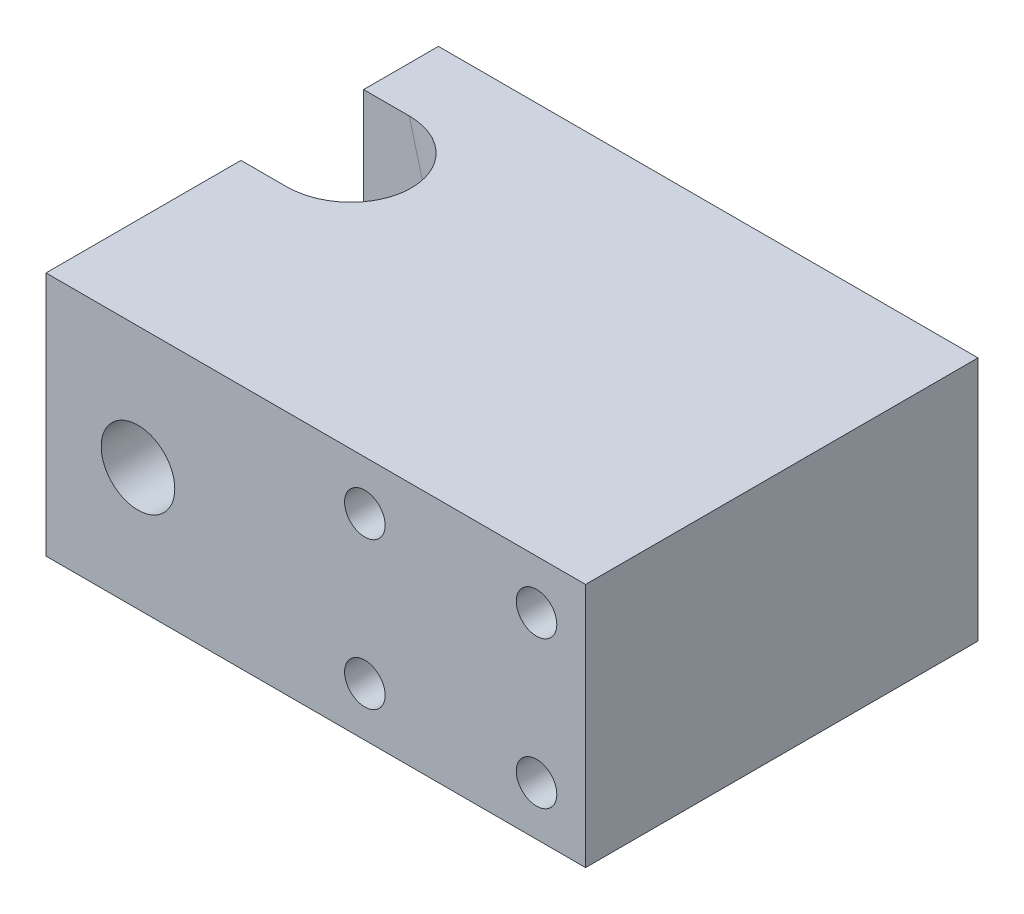
ISO-10303-21;
HEADER;
FILE_DESCRIPTION(('STEP AP214'),'2;1');
FILE_NAME('part.step','',(''),(''),'','','');
FILE_SCHEMA(('AUTOMOTIVE_DESIGN { 1 0 10303 214 1 1 1 1 }'));
ENDSEC;
DATA;
#1=APPLICATION_CONTEXT('core data for automotive mechanical design processes');
#2=APPLICATION_PROTOCOL_DEFINITION('international standard','automotive_design',2000,#1);
#3=PRODUCT_CONTEXT('',#1,'mechanical');
#4=PRODUCT('Part','Part','',(#3));
#5=PRODUCT_RELATED_PRODUCT_CATEGORY('part','',(#4));
#6=PRODUCT_DEFINITION_FORMATION('','',#4);
#7=PRODUCT_DEFINITION_CONTEXT('part definition',#1,'design');
#8=PRODUCT_DEFINITION('design','',#6,#7);
#9=PRODUCT_DEFINITION_SHAPE('','',#8);
#10=(LENGTH_UNIT() NAMED_UNIT(*) SI_UNIT(.MILLI.,.METRE.));
#11=(NAMED_UNIT(*) PLANE_ANGLE_UNIT() SI_UNIT($,.RADIAN.));
#12=(NAMED_UNIT(*) SI_UNIT($,.STERADIAN.) SOLID_ANGLE_UNIT());
#13=UNCERTAINTY_MEASURE_WITH_UNIT(LENGTH_MEASURE(1.E-05),#10,'distance_accuracy_value','');
#14=(GEOMETRIC_REPRESENTATION_CONTEXT(3) GLOBAL_UNCERTAINTY_ASSIGNED_CONTEXT((#13)) GLOBAL_UNIT_ASSIGNED_CONTEXT((#10,
#11,#12)) REPRESENTATION_CONTEXT('',''));
#15=CARTESIAN_POINT('',(0.,0.,0.));
#16=DIRECTION('',(0.,0.,1.));
#17=DIRECTION('',(1.,0.,0.));
#18=AXIS2_PLACEMENT_3D('',#15,#16,#17);
#19=CARTESIAN_POINT('',(0.,25.4,0.));
#20=DIRECTION('',(1.,0.,0.));
#21=DIRECTION('',(0.,0.,-1.));
#22=AXIS2_PLACEMENT_3D('',#19,#20,#21);
#23=PLANE('',#22);
#24=DIRECTION('',(0.,1.,0.));
#25=VECTOR('',#24,1.);
#26=CARTESIAN_POINT('',(0.,25.4,-20.19));
#27=LINE('',#26,#25);
#28=CARTESIAN_POINT('',(0.,0.,-20.19));
#29=VERTEX_POINT('',#28);
#30=CARTESIAN_POINT('',(0.,25.4,-20.19));
#31=VERTEX_POINT('',#30);
#32=EDGE_CURVE('E280',#29,#31,#27,.T.);
#33=ORIENTED_EDGE('',*,*,#32,.F.);
#34=DIRECTION('',(0.,0.,1.));
#35=VECTOR('',#34,1.);
#36=CARTESIAN_POINT('',(0.,0.,0.));
#37=LINE('',#36,#35);
#38=CARTESIAN_POINT('',(0.,0.,0.));
#39=VERTEX_POINT('',#38);
#40=EDGE_CURVE('E144',#29,#39,#37,.T.);
#41=ORIENTED_EDGE('',*,*,#40,.T.);
#42=DIRECTION('',(0.,-1.,0.));
#43=VECTOR('',#42,1.);
#44=CARTESIAN_POINT('',(0.,25.4,0.));
#45=LINE('',#44,#43);
#46=CARTESIAN_POINT('',(0.,25.4,0.));
#47=VERTEX_POINT('',#46);
#48=EDGE_CURVE('E181',#47,#39,#45,.T.);
#49=ORIENTED_EDGE('',*,*,#48,.F.);
#50=DIRECTION('',(0.,0.,1.));
#51=VECTOR('',#50,1.);
#52=CARTESIAN_POINT('',(0.,25.4,0.));
#53=LINE('',#52,#51);
#54=EDGE_CURVE('E159',#31,#47,#53,.T.);
#55=ORIENTED_EDGE('',*,*,#54,.F.);
#56=EDGE_LOOP('',(#33,#41,#49,#55));
#57=FACE_BOUND('',#56,.T.);
#58=ADVANCED_FACE('F37',(#57),#23,.F.);
#59=CARTESIAN_POINT('',(0.,25.4,0.));
#60=DIRECTION('',(0.,-1.,0.));
#61=DIRECTION('',(0.,0.,-1.));
#62=AXIS2_PLACEMENT_3D('',#59,#60,#61);
#63=PLANE('',#62);
#64=DIRECTION('',(1.,0.,0.));
#65=VECTOR('',#64,1.);
#66=CARTESIAN_POINT('',(0.,25.4,-20.19));
#67=LINE('',#66,#65);
#68=CARTESIAN_POINT('',(4.72442241257112,25.4,-20.19));
#69=VERTEX_POINT('',#68);
#70=EDGE_CURVE('E282',#31,#69,#67,.T.);
#71=ORIENTED_EDGE('',*,*,#70,.F.);
#72=ORIENTED_EDGE('',*,*,#54,.T.);
#73=DIRECTION('',(1.,0.,0.));
#74=VECTOR('',#73,1.);
#75=CARTESIAN_POINT('',(0.,25.4,0.));
#76=LINE('',#75,#74);
#77=CARTESIAN_POINT('',(55.88,25.4,0.));
#78=VERTEX_POINT('',#77);
#79=EDGE_CURVE('E158',#47,#78,#76,.T.);
#80=ORIENTED_EDGE('',*,*,#79,.T.);
#81=DIRECTION('',(0.,0.,-1.));
#82=VECTOR('',#81,1.);
#83=CARTESIAN_POINT('',(55.88,25.4,0.));
#84=LINE('',#83,#82);
#85=CARTESIAN_POINT('',(55.88,25.4,-40.64));
#86=VERTEX_POINT('',#85);
#87=EDGE_CURVE('E161',#78,#86,#84,.T.);
#88=ORIENTED_EDGE('',*,*,#87,.T.);
#89=DIRECTION('',(-1.,0.,0.));
#90=VECTOR('',#89,1.);
#91=CARTESIAN_POINT('',(0.,25.4,-40.64));
#92=LINE('',#91,#90);
#93=CARTESIAN_POINT('',(0.,25.4,-40.64));
#94=VERTEX_POINT('',#93);
#95=EDGE_CURVE('E163',#86,#94,#92,.T.);
#96=ORIENTED_EDGE('',*,*,#95,.T.);
#97=CARTESIAN_POINT('',(0.,25.4,-32.89));
#98=VERTEX_POINT('',#97);
#99=EDGE_CURVE('E155',#94,#98,#53,.T.);
#100=ORIENTED_EDGE('',*,*,#99,.T.);
#101=DIRECTION('',(1.,0.,0.));
#102=VECTOR('',#101,1.);
#103=CARTESIAN_POINT('',(0.,25.4,-32.89));
#104=LINE('',#103,#102);
#105=CARTESIAN_POINT('',(4.72442241257112,25.4,-32.89));
#106=VERTEX_POINT('',#105);
#107=EDGE_CURVE('E270',#98,#106,#104,.T.);
#108=ORIENTED_EDGE('',*,*,#107,.T.);
#109=CARTESIAN_POINT('',(4.72442241257112,25.4,-26.54));
#110=DIRECTION('',(0.,-1.,0.));
#111=DIRECTION('',(-1.,0.,0.));
#112=AXIS2_PLACEMENT_3D('',#109,#110,#111);
#113=ELLIPSE('',#112,6.57400374560403,6.35);
#114=EDGE_CURVE('E268',#106,#69,#113,.T.);
#115=ORIENTED_EDGE('',*,*,#114,.T.);
#116=EDGE_LOOP('',(#71,#72,#80,#88,#96,#100,#108,#115));
#117=FACE_BOUND('',#116,.T.);
#118=ADVANCED_FACE('F239',(#117),#63,.F.);
#119=CARTESIAN_POINT('',(0.,0.,0.));
#120=DIRECTION('',(0.,-1.,0.));
#121=DIRECTION('',(0.,0.,-1.));
#122=AXIS2_PLACEMENT_3D('',#119,#120,#121);
#123=PLANE('',#122);
#124=ORIENTED_EDGE('',*,*,#40,.F.);
#125=DIRECTION('',(1.,0.,0.));
#126=VECTOR('',#125,1.);
#127=CARTESIAN_POINT('',(0.,0.,-20.19));
#128=LINE('',#127,#126);
#129=CARTESIAN_POINT('',(11.5303319003217,0.,-20.19));
#130=VERTEX_POINT('',#129);
#131=EDGE_CURVE('E278',#29,#130,#128,.T.);
#132=ORIENTED_EDGE('',*,*,#131,.T.);
#133=CARTESIAN_POINT('',(11.5303319003217,0.,-26.54));
#134=DIRECTION('',(0.,-1.,0.));
#135=DIRECTION('',(-1.,0.,0.));
#136=AXIS2_PLACEMENT_3D('',#133,#134,#135);
#137=ELLIPSE('',#136,6.57400374560403,6.35);
#138=CARTESIAN_POINT('',(11.5303319003217,0.,-32.89));
#139=VERTEX_POINT('',#138);
#140=EDGE_CURVE('E131',#139,#130,#137,.T.);
#141=ORIENTED_EDGE('',*,*,#140,.F.);
#142=DIRECTION('',(1.,0.,0.));
#143=VECTOR('',#142,1.);
#144=CARTESIAN_POINT('',(0.,0.,-32.89));
#145=LINE('',#144,#143);
#146=CARTESIAN_POINT('',(0.,0.,-32.89));
#147=VERTEX_POINT('',#146);
#148=EDGE_CURVE('E129',#147,#139,#145,.T.);
#149=ORIENTED_EDGE('',*,*,#148,.F.);
#150=CARTESIAN_POINT('',(0.,0.,-40.64));
#151=VERTEX_POINT('',#150);
#152=EDGE_CURVE('E147',#151,#147,#37,.T.);
#153=ORIENTED_EDGE('',*,*,#152,.F.);
#154=DIRECTION('',(-1.,0.,0.));
#155=VECTOR('',#154,1.);
#156=CARTESIAN_POINT('',(0.,0.,-40.64));
#157=LINE('',#156,#155);
#158=CARTESIAN_POINT('',(55.88,0.,-40.64));
#159=VERTEX_POINT('',#158);
#160=EDGE_CURVE('E171',#159,#151,#157,.T.);
#161=ORIENTED_EDGE('',*,*,#160,.F.);
#162=DIRECTION('',(0.,0.,-1.));
#163=VECTOR('',#162,1.);
#164=CARTESIAN_POINT('',(55.88,0.,0.));
#165=LINE('',#164,#163);
#166=CARTESIAN_POINT('',(55.88,0.,0.));
#167=VERTEX_POINT('',#166);
#168=EDGE_CURVE('E169',#167,#159,#165,.T.);
#169=ORIENTED_EDGE('',*,*,#168,.F.);
#170=DIRECTION('',(1.,0.,0.));
#171=VECTOR('',#170,1.);
#172=CARTESIAN_POINT('',(0.,0.,0.));
#173=LINE('',#172,#171);
#174=EDGE_CURVE('E167',#39,#167,#173,.T.);
#175=ORIENTED_EDGE('',*,*,#174,.F.);
#176=EDGE_LOOP('',(#124,#132,#141,#149,#153,#161,#169,#175));
#177=FACE_BOUND('',#176,.T.);
#178=ADVANCED_FACE('F244',(#177),#123,.T.);
#179=CARTESIAN_POINT('',(9.525,12.7,-40.64));
#180=DIRECTION('',(0.,0.,1.));
#181=DIRECTION('',(1.,0.,0.));
#182=AXIS2_PLACEMENT_3D('',#179,#180,#181);
#183=CYLINDRICAL_SURFACE('',#182,3.81);
#184=CARTESIAN_POINT('',(9.525,12.7,0.));
#185=DIRECTION('',(0.,0.,1.));
#186=DIRECTION('',(1.,0.,0.));
#187=AXIS2_PLACEMENT_3D('',#184,#185,#186);
#188=CIRCLE('',#187,3.81);
#189=CARTESIAN_POINT('',(13.335,12.7,0.));
#190=VERTEX_POINT('',#189);
#191=EDGE_CURVE('E145',#190,#190,#188,.T.);
#192=ORIENTED_EDGE('',*,*,#191,.T.);
#193=EDGE_LOOP('',(#192));
#194=FACE_BOUND('',#193,.T.);
#195=CARTESIAN_POINT('',(9.525,12.7,-20.19));
#196=DIRECTION('',(0.,0.,-1.));
#197=DIRECTION('',(-1.,0.,0.));
#198=AXIS2_PLACEMENT_3D('',#195,#196,#197);
#199=CIRCLE('',#198,3.81);
#200=CARTESIAN_POINT('',(7.29887760075357,15.7920024358938,-20.19));
#201=VERTEX_POINT('',#200);
#202=CARTESIAN_POINT('',(9.14312266826595,8.90918614232936,-20.19));
#203=VERTEX_POINT('',#202);
#204=EDGE_CURVE('E125',#201,#203,#199,.F.);
#205=ORIENTED_EDGE('',*,*,#204,.F.);
#206=CARTESIAN_POINT('',(7.29887760075357,15.7920024358938,-20.19));
#207=CARTESIAN_POINT('',(7.37588821554804,15.8474677696084,-20.189983748668));
#208=CARTESIAN_POINT('',(7.45499525906798,15.900032428448,-20.191859662143));
#209=CARTESIAN_POINT('',(7.61675874663452,15.999041260314,-20.1996000488794));
#210=CARTESIAN_POINT('',(7.69941503588709,16.0454856999041,-20.2054643483597));
#211=CARTESIAN_POINT('',(7.86730898172459,16.1317695337751,-20.2213543357153));
#212=CARTESIAN_POINT('',(7.95253518481344,16.1716342305359,-20.2313635369643));
#213=CARTESIAN_POINT('',(8.1251776097193,16.2447686062806,-20.2556195622989));
#214=CARTESIAN_POINT('',(8.21259371927783,16.2780386225435,-20.2698661695729));
#215=CARTESIAN_POINT('',(8.38894413758513,16.337876643913,-20.3025910657021));
#216=CARTESIAN_POINT('',(8.47787884528105,16.3644428580338,-20.3210704828834));
#217=CARTESIAN_POINT('',(8.65655973171753,16.4108554034493,-20.3621456306375));
#218=CARTESIAN_POINT('',(8.74630620762368,16.4306991624093,-20.3847429318357));
#219=CARTESIAN_POINT('',(9.01576942865032,16.4802203092433,-20.4584586470324));
#220=CARTESIAN_POINT('',(9.19580400877357,16.4999189391056,-20.5155183812784));
#221=CARTESIAN_POINT('',(9.55740442674199,16.514301389552,-20.6451548398031));
#222=CARTESIAN_POINT('',(9.7388410393498,16.5081808608286,-20.7181622944671));
#223=CARTESIAN_POINT('',(10.0940870566885,16.471490873795,-20.8755360491311));
#224=CARTESIAN_POINT('',(10.2678942133258,16.4409142596001,-20.9599056677061));
#225=CARTESIAN_POINT('',(10.6337600080237,16.3507446674273,-21.1515222889631));
#226=CARTESIAN_POINT('',(10.8240561181414,16.2871761829935,-21.2602416778512));
#227=CARTESIAN_POINT('',(11.1897887415193,16.1327970347096,-21.4839378036471));
#228=CARTESIAN_POINT('',(11.3651949913833,16.0419325157285,-21.5989265394609));
#229=CARTESIAN_POINT('',(11.6327559764238,15.8760650565887,-21.7832255731062));
#230=CARTESIAN_POINT('',(11.7301636468208,15.8092385447935,-21.8524231128882));
#231=CARTESIAN_POINT('',(11.9189831983781,15.6663065585903,-21.9895851215926));
#232=CARTESIAN_POINT('',(12.0103925181879,15.5901971594516,-22.0575490549076));
#233=CARTESIAN_POINT('',(12.186699091233,15.4286860036282,-22.1903254947206));
#234=CARTESIAN_POINT('',(12.271608472899,15.3433023100964,-22.2551437836971));
#235=CARTESIAN_POINT('',(12.4345672710965,15.1627799438534,-22.3794538412913));
#236=CARTESIAN_POINT('',(12.5126227878937,15.0676501125065,-22.4389503474479));
#237=CARTESIAN_POINT('',(12.6675599693142,14.8584274322646,-22.554496611453));
#238=CARTESIAN_POINT('',(12.7437588516888,14.743406547188,-22.6098056671192));
#239=CARTESIAN_POINT('',(12.885304360886,14.5011126276498,-22.7055906338988));
#240=CARTESIAN_POINT('',(12.9506715857715,14.3738635925792,-22.7460948797866));
#241=CARTESIAN_POINT('',(13.0390172408645,14.1741791748021,-22.7918313790436));
#242=CARTESIAN_POINT('',(13.0670101721369,14.1056347546324,-22.8046091088589));
#243=CARTESIAN_POINT('',(13.1191729260859,13.9663103796,-22.8243815057154));
#244=CARTESIAN_POINT('',(13.1433448130121,13.8955316567449,-22.8313793039524));
#245=CARTESIAN_POINT('',(13.1875390847034,13.7523850833845,-22.8392294083607));
#246=CARTESIAN_POINT('',(13.2075633369184,13.6800179643491,-22.840084486125));
#247=CARTESIAN_POINT('',(13.2432599202725,13.5344282637572,-22.8356248883296));
#248=CARTESIAN_POINT('',(13.258932503988,13.4612057321071,-22.8303105709425));
#249=CARTESIAN_POINT('',(13.295360906114,13.2626975623718,-22.8078879609613));
#250=CARTESIAN_POINT('',(13.3118686616062,13.1372275888669,-22.7850956852954));
#251=CARTESIAN_POINT('',(13.332371116634,12.8888094550595,-22.7251658916225));
#252=CARTESIAN_POINT('',(13.3363512757895,12.76586438957,-22.6880117603625));
#253=CARTESIAN_POINT('',(13.331798150708,12.451091174922,-22.5774503932035));
#254=CARTESIAN_POINT('',(13.3142963453879,12.2623192089441,-22.495680170807));
#255=CARTESIAN_POINT('',(13.2690420392041,11.9880354186318,-22.3618875497663));
#256=CARTESIAN_POINT('',(13.2507329225683,11.8979101852149,-22.3153263800793));
#257=CARTESIAN_POINT('',(13.2080770383771,11.7205357261821,-22.2195536469465));
#258=CARTESIAN_POINT('',(13.1837320031273,11.6332856835135,-22.17034284711));
#259=CARTESIAN_POINT('',(13.1189942971672,11.429297212113,-22.0513691852098));
#260=CARTESIAN_POINT('',(13.0760107384433,11.3138256146842,-21.9808448143921));
#261=CARTESIAN_POINT('',(12.9794511068012,11.0881910068086,-21.8385059267657));
#262=CARTESIAN_POINT('',(12.925871111969,10.9780299807233,-21.7666909412533));
#263=CARTESIAN_POINT('',(12.8083198557379,10.7632829417686,-21.62340733836));
#264=CARTESIAN_POINT('',(12.7443565219227,10.6586927558935,-21.5519384992361));
#265=CARTESIAN_POINT('',(12.6060811195501,10.4554134594179,-21.4106712361812));
#266=CARTESIAN_POINT('',(12.5317671778308,10.3567254215674,-21.3408731172879));
#267=CARTESIAN_POINT('',(12.319524489147,10.1019941222244,-21.1584905381409));
#268=CARTESIAN_POINT('',(12.1722426910152,9.9516347922979,-21.0484434701866));
#269=CARTESIAN_POINT('',(11.9302919745705,9.74331312286687,-20.893990014485));
#270=CARTESIAN_POINT('',(11.8461725202371,9.67676383647853,-20.8442916899503));
#271=CARTESIAN_POINT('',(11.6710281769443,9.5500264687455,-20.7490417922428));
#272=CARTESIAN_POINT('',(11.5800044084807,9.48983735899078,-20.7034895488343));
#273=CARTESIAN_POINT('',(11.4065641607914,9.38573640560393,-20.6241582645925));
#274=CARTESIAN_POINT('',(11.325109893876,9.34076238309594,-20.5896629082002));
#275=CARTESIAN_POINT('',(11.1579141225255,9.25638923520169,-20.5244655034477));
#276=CARTESIAN_POINT('',(11.072173421826,9.21698906994591,-20.4937627476686));
#277=CARTESIAN_POINT('',(10.8968513236891,9.14428273971723,-20.436494784781));
#278=CARTESIAN_POINT('',(10.8072715397538,9.1109740450112,-20.4099278607837));
#279=CARTESIAN_POINT('',(10.6248083210705,9.05092568366541,-20.3611971147265));
#280=CARTESIAN_POINT('',(10.531926091169,9.02418364887009,-20.3390317058875));
#281=CARTESIAN_POINT('',(10.3340241147508,8.97535567696632,-20.2972898003389));
#282=CARTESIAN_POINT('',(10.2287199917924,8.95400362821173,-20.2781944513378));
#283=CARTESIAN_POINT('',(10.0158170628798,8.92020862381462,-20.2456477276708));
#284=CARTESIAN_POINT('',(9.90821791558504,8.90776700307623,-20.2321971988012));
#285=CARTESIAN_POINT('',(9.6910299364845,8.89205358089758,-20.2108069067747));
#286=CARTESIAN_POINT('',(9.58143238108303,8.8888479401425,-20.2029072090759));
#287=CARTESIAN_POINT('',(9.3621001690675,8.89189588249173,-20.1924885263736));
#288=CARTESIAN_POINT('',(9.25236549894755,8.89815048533763,-20.1899701215028));
#289=CARTESIAN_POINT('',(9.14312266826595,8.90918614232937,-20.19));
#290=B_SPLINE_CURVE_WITH_KNOTS('',3,(#206,#207,#208,#209,#210,#211,#212,#213,#214,#215,#216,
#217,#218,#219,#220,#221,#222,#223,#224,#225,#226,#227,#228,#229,#230,#231,#232,#233,#234,#235,
#236,#237,#238,#239,#240,#241,#242,#243,#244,#245,#246,#247,#248,#249,#250,#251,#252,#253,#254,
#255,#256,#257,#258,#259,#260,#261,#262,#263,#264,#265,#266,#267,#268,#269,#270,#271,#272,#273,
#274,#275,#276,#277,#278,#279,#280,#281,#282,#283,#284,#285,#286,#287,#288,#289),.UNSPECIFIED.,
.F.,.F.,(4,2,2,2,2,2,2,2,2,2,2,2,2,2,2,2,2,2,2,2,2,2,2,2,2,2,2,2,2,2,2,2,2,2,2,2,2,2,2,2,2,4),
(0.,0.284639796308757,0.569267191144455,0.852773172920135,1.13626465129527,1.41983178717432,
1.70350730723625,2.27056003771185,2.85540660777862,3.44042436739706,4.12259723151591,
4.80612496396936,5.21644933821461,5.62694779964627,6.03666062006325,6.44600499986505,
6.89067986637461,7.33449916183455,7.55960136588614,7.78458154388661,8.00946020453746,
8.23432581020603,8.61827648761896,9.00267264026686,9.61831983316983,9.92741875769708,
10.2364290734737,10.6617930262583,11.0873147088067,11.512513024401,11.9377883888725,
12.6469206028601,13.0012212880588,13.3554645965918,13.6528709841303,13.9502218135832,
14.2474488740821,14.5445685866904,14.8714257531556,15.1983318770626,15.5275739959331,
15.8568516071041),.UNSPECIFIED.);
#291=EDGE_CURVE('E184',#201,#203,#290,.T.);
#292=ORIENTED_EDGE('',*,*,#291,.T.);
#293=EDGE_LOOP('',(#205,#292));
#294=FACE_BOUND('',#293,.T.);
#295=ADVANCED_FACE('F139',(#194,#294),#183,.F.);
#296=CARTESIAN_POINT('',(0.,25.4,0.));
#297=DIRECTION('',(0.,0.,-1.));
#298=DIRECTION('',(-1.,0.,0.));
#299=AXIS2_PLACEMENT_3D('',#296,#297,#298);
#300=PLANE('',#299);
#301=CARTESIAN_POINT('',(50.8,5.08,0.));
#302=DIRECTION('',(0.,0.,1.));
#303=DIRECTION('',(1.,0.,0.));
#304=AXIS2_PLACEMENT_3D('',#301,#302,#303);
#305=CIRCLE('',#304,2.1);
#306=CARTESIAN_POINT('',(52.9,5.08,0.));
#307=VERTEX_POINT('',#306);
#308=EDGE_CURVE('E284',#307,#307,#305,.T.);
#309=ORIENTED_EDGE('',*,*,#308,.F.);
#310=EDGE_LOOP('',(#309));
#311=FACE_BOUND('',#310,.T.);
#312=CARTESIAN_POINT('',(33.02,5.07999999999988,0.));
#313=DIRECTION('',(0.,0.,1.));
#314=DIRECTION('',(1.,0.,0.));
#315=AXIS2_PLACEMENT_3D('',#312,#313,#314);
#316=CIRCLE('',#315,2.1);
#317=CARTESIAN_POINT('',(35.12,5.07999999999988,0.));
#318=VERTEX_POINT('',#317);
#319=EDGE_CURVE('E290',#318,#318,#316,.T.);
#320=ORIENTED_EDGE('',*,*,#319,.F.);
#321=EDGE_LOOP('',(#320));
#322=FACE_BOUND('',#321,.T.);
#323=CARTESIAN_POINT('',(33.02,20.3199999999999,0.));
#324=DIRECTION('',(0.,0.,1.));
#325=DIRECTION('',(1.,0.,0.));
#326=AXIS2_PLACEMENT_3D('',#323,#324,#325);
#327=CIRCLE('',#326,2.1);
#328=CARTESIAN_POINT('',(35.1199999999999,20.3199999999999,0.));
#329=VERTEX_POINT('',#328);
#330=EDGE_CURVE('E296',#329,#329,#327,.T.);
#331=ORIENTED_EDGE('',*,*,#330,.F.);
#332=EDGE_LOOP('',(#331));
#333=FACE_BOUND('',#332,.T.);
#334=ORIENTED_EDGE('',*,*,#174,.T.);
#335=DIRECTION('',(0.,-1.,0.));
#336=VECTOR('',#335,1.);
#337=CARTESIAN_POINT('',(55.88,25.4,0.));
#338=LINE('',#337,#336);
#339=EDGE_CURVE('E178',#78,#167,#338,.T.);
#340=ORIENTED_EDGE('',*,*,#339,.F.);
#341=ORIENTED_EDGE('',*,*,#79,.F.);
#342=ORIENTED_EDGE('',*,*,#48,.T.);
#343=EDGE_LOOP('',(#334,#340,#341,#342));
#344=FACE_BOUND('',#343,.T.);
#345=ORIENTED_EDGE('',*,*,#191,.F.);
#346=EDGE_LOOP('',(#345));
#347=FACE_BOUND('',#346,.T.);
#348=CARTESIAN_POINT('',(50.7999999999999,20.32,0.));
#349=DIRECTION('',(0.,0.,1.));
#350=DIRECTION('',(1.,0.,0.));
#351=AXIS2_PLACEMENT_3D('',#348,#349,#350);
#352=CIRCLE('',#351,2.1);
#353=CARTESIAN_POINT('',(52.8999999999999,20.32,0.));
#354=VERTEX_POINT('',#353);
#355=EDGE_CURVE('E301',#354,#354,#352,.T.);
#356=ORIENTED_EDGE('',*,*,#355,.F.);
#357=EDGE_LOOP('',(#356));
#358=FACE_BOUND('',#357,.T.);
#359=ADVANCED_FACE('F249',(#311,#322,#333,#344,#347,#358),#300,.F.);
#360=ORIENTED_EDGE('',*,*,#152,.T.);
#361=DIRECTION('',(0.,1.,0.));
#362=VECTOR('',#361,1.);
#363=CARTESIAN_POINT('',(0.,25.4,-32.89));
#364=LINE('',#363,#362);
#365=EDGE_CURVE('E261',#147,#98,#364,.T.);
#366=ORIENTED_EDGE('',*,*,#365,.T.);
#367=ORIENTED_EDGE('',*,*,#99,.F.);
#368=DIRECTION('',(0.,-1.,0.));
#369=VECTOR('',#368,1.);
#370=CARTESIAN_POINT('',(0.,25.4,-40.64));
#371=LINE('',#370,#369);
#372=EDGE_CURVE('E164',#94,#151,#371,.T.);
#373=ORIENTED_EDGE('',*,*,#372,.T.);
#374=EDGE_LOOP('',(#360,#366,#367,#373));
#375=FACE_BOUND('',#374,.T.);
#376=ADVANCED_FACE('F39',(#375),#23,.F.);
#377=CARTESIAN_POINT('',(55.88,25.4,0.));
#378=DIRECTION('',(-1.,0.,0.));
#379=DIRECTION('',(0.,0.,1.));
#380=AXIS2_PLACEMENT_3D('',#377,#378,#379);
#381=PLANE('',#380);
#382=ORIENTED_EDGE('',*,*,#168,.T.);
#383=DIRECTION('',(0.,-1.,0.));
#384=VECTOR('',#383,1.);
#385=CARTESIAN_POINT('',(55.88,25.4,-40.64));
#386=LINE('',#385,#384);
#387=EDGE_CURVE('E175',#86,#159,#386,.T.);
#388=ORIENTED_EDGE('',*,*,#387,.F.);
#389=ORIENTED_EDGE('',*,*,#87,.F.);
#390=ORIENTED_EDGE('',*,*,#339,.T.);
#391=EDGE_LOOP('',(#382,#388,#389,#390));
#392=FACE_BOUND('',#391,.T.);
#393=ADVANCED_FACE('F248',(#392),#381,.F.);
#394=CARTESIAN_POINT('',(0.,25.4,-40.64));
#395=DIRECTION('',(0.,0.,1.));
#396=DIRECTION('',(1.,0.,0.));
#397=AXIS2_PLACEMENT_3D('',#394,#395,#396);
#398=PLANE('',#397);
#399=CARTESIAN_POINT('',(9.525,12.7,-40.64));
#400=DIRECTION('',(0.,0.,1.));
#401=DIRECTION('',(1.,0.,0.));
#402=AXIS2_PLACEMENT_3D('',#399,#400,#401);
#403=CIRCLE('',#402,3.81);
#404=CARTESIAN_POINT('',(13.335,12.7,-40.64));
#405=VERTEX_POINT('',#404);
#406=EDGE_CURVE('E142',#405,#405,#403,.T.);
#407=ORIENTED_EDGE('',*,*,#406,.T.);
#408=EDGE_LOOP('',(#407));
#409=FACE_BOUND('',#408,.T.);
#410=ORIENTED_EDGE('',*,*,#160,.T.);
#411=ORIENTED_EDGE('',*,*,#372,.F.);
#412=ORIENTED_EDGE('',*,*,#95,.F.);
#413=ORIENTED_EDGE('',*,*,#387,.T.);
#414=EDGE_LOOP('',(#410,#411,#412,#413));
#415=FACE_BOUND('',#414,.T.);
#416=ADVANCED_FACE('F137',(#409,#415),#398,.F.);
#417=CARTESIAN_POINT('',(9.14312266826595,8.90918614232936,-32.89));
#418=CARTESIAN_POINT('',(9.23754848389631,8.89965706170037,-32.890016251332));
#419=CARTESIAN_POINT('',(9.33233952262265,8.89368825356401,-32.888140337857));
#420=CARTESIAN_POINT('',(9.52193522819303,8.88882583375232,-32.8803999511206));
#421=CARTESIAN_POINT('',(9.61673989426337,8.88993191382904,-32.8745356516403));
#422=CARTESIAN_POINT('',(9.80528223343576,8.89915489467957,-32.8586456642847));
#423=CARTESIAN_POINT('',(9.89902263875918,8.90724415611499,-32.8486364630357));
#424=CARTESIAN_POINT('',(10.085102552371,8.93022914128311,-32.8243804377011));
#425=CARTESIAN_POINT('',(10.1774421320801,8.9451245167944,-32.8101338304271));
#426=CARTESIAN_POINT('',(10.360085084987,8.98147847932986,-32.7774089342979));
#427=CARTESIAN_POINT('',(10.4503879081902,9.00293881686678,-32.7589295171166));
#428=CARTESIAN_POINT('',(10.6283363677227,9.05208481670092,-32.7178543693625));
#429=CARTESIAN_POINT('',(10.7159809752375,9.07977285528803,-32.6952570681643));
#430=CARTESIAN_POINT('',(10.9741035434492,9.17161789461857,-32.6215413529676));
#431=CARTESIAN_POINT('',(11.1398673783267,9.24457567079975,-32.5644816187216));
#432=CARTESIAN_POINT('',(11.4602137515297,9.41292031232866,-32.4348451601969));
#433=CARTESIAN_POINT('',(11.6142822028629,9.50893915199161,-32.3618377055329));
#434=CARTESIAN_POINT('',(11.9035892849547,9.71833662149662,-32.2044639508689));
#435=CARTESIAN_POINT('',(12.0388223908646,9.83172032446978,-32.1200943322939));
#436=CARTESIAN_POINT('',(12.3105866673624,10.0927423792893,-31.9284777110369));
#437=CARTESIAN_POINT('',(12.4436036907488,10.2429423567479,-31.8197583221487));
#438=CARTESIAN_POINT('',(12.6831478594448,10.5595049326653,-31.5960621963529));
#439=CARTESIAN_POINT('',(12.7896218683191,10.7258990393375,-31.4810734605391));
#440=CARTESIAN_POINT('',(12.9384027488558,11.003324965134,-31.2967744268938));
#441=CARTESIAN_POINT('',(12.9893470100455,11.1099022571935,-31.2275768871118));
#442=CARTESIAN_POINT('',(13.0814035453238,11.3280947640375,-31.0904148784074));
#443=CARTESIAN_POINT('',(13.1225116388523,11.4397120970632,-31.0224509450924));
#444=CARTESIAN_POINT('',(13.1944420320518,11.6677381475234,-30.8896745052794));
#445=CARTESIAN_POINT('',(13.2252838668284,11.7841372860239,-30.8248562163029));
#446=CARTESIAN_POINT('',(13.276149142716,12.0219536402404,-30.7005461587087));
#447=CARTESIAN_POINT('',(13.2961822874945,12.1433662492431,-30.6410496525521));
#448=CARTESIAN_POINT('',(13.3257504824745,12.4020269960907,-30.525503388547));
#449=CARTESIAN_POINT('',(13.3342302078125,12.5397374457201,-30.4701943328808));
#450=CARTESIAN_POINT('',(13.3356652547998,12.8203428898213,-30.3744093661012));
#451=CARTESIAN_POINT('',(13.3286504145902,12.9632273992422,-30.3339051202134));
#452=CARTESIAN_POINT('',(13.3053177873262,13.1803320053236,-30.2881686209564));
#453=CARTESIAN_POINT('',(13.2952881668497,13.2536896801144,-30.2753908911411));
#454=CARTESIAN_POINT('',(13.2708002493846,13.4004295052334,-30.2556184942846));
#455=CARTESIAN_POINT('',(13.2563443560925,13.4738116207365,-30.2486206960476));
#456=CARTESIAN_POINT('',(13.2230444313988,13.6198773255769,-30.2407705916394));
#457=CARTESIAN_POINT('',(13.2042023829911,13.6925612151678,-30.239915513875));
#458=CARTESIAN_POINT('',(13.162321680708,13.8364938860868,-30.2443751116704));
#459=CARTESIAN_POINT('',(13.1392832705236,13.907742750483,-30.2496894290575));
#460=CARTESIAN_POINT('',(13.0715771073163,14.0978700693954,-30.2721120390387));
#461=CARTESIAN_POINT('',(13.0231382561796,14.2147841316089,-30.2949043147046));
#462=CARTESIAN_POINT('',(12.9166848361699,14.4401717737607,-30.3548341083775));
#463=CARTESIAN_POINT('',(12.858659222365,14.5486354033224,-30.3919882396375));
#464=CARTESIAN_POINT('',(12.6973294930537,14.8189604410977,-30.5025496067965));
#465=CARTESIAN_POINT('',(12.5877865020455,14.9736908564969,-30.584319829193));
#466=CARTESIAN_POINT('',(12.4114532281036,15.1886004336617,-30.7181124502337));
#467=CARTESIAN_POINT('',(12.3505344512676,15.2574966170048,-30.7646736199207));
#468=CARTESIAN_POINT('',(12.2249061424208,15.3897794624141,-30.8604463530535));
#469=CARTESIAN_POINT('',(12.1601977021041,15.4531676982215,-30.90965715289));
#470=CARTESIAN_POINT('',(12.0021389684596,15.5974580435535,-31.0286308147902));
#471=CARTESIAN_POINT('',(11.9071783159454,15.6759676009804,-31.0991551856079));
#472=CARTESIAN_POINT('',(11.7107379180254,15.8230930875525,-31.2414940732343));
#473=CARTESIAN_POINT('',(11.6092557683235,15.8917053372333,-31.3133090587467));
#474=CARTESIAN_POINT('',(11.4000798747032,16.01890610024,-31.45659266164));
#475=CARTESIAN_POINT('',(11.2923909097709,16.0775021912868,-31.5280615007639));
#476=CARTESIAN_POINT('',(11.0710012503599,16.1844095249118,-31.6693287638188));
#477=CARTESIAN_POINT('',(10.9572994700504,16.2327189018803,-31.7391268827121));
#478=CARTESIAN_POINT('',(10.6461262602113,16.3472013339085,-31.9215094618591));
#479=CARTESIAN_POINT('',(10.4433968165508,16.4037754342549,-32.0315565298134));
#480=CARTESIAN_POINT('',(10.1297005149303,16.4632119339186,-32.186009985515));
#481=CARTESIAN_POINT('',(10.0235762873309,16.4787855793679,-32.2357083100497));
#482=CARTESIAN_POINT('',(9.80852815284368,16.5009711877871,-32.3309582077572));
#483=CARTESIAN_POINT('',(9.69960470212869,16.5075846016341,-32.3765104511657));
#484=CARTESIAN_POINT('',(9.49735056489766,16.5110185479806,-32.4558417354075));
#485=CARTESIAN_POINT('',(9.40432208924832,16.5092400605252,-32.4903370917998));
#486=CARTESIAN_POINT('',(9.21733972990632,16.4987114643237,-32.5555344965523));
#487=CARTESIAN_POINT('',(9.12338602233433,16.4899626579987,-32.5862372523314));
#488=CARTESIAN_POINT('',(8.93519946638869,16.4652671379242,-32.643505215219));
#489=CARTESIAN_POINT('',(8.84096675048219,16.4493234217389,-32.6700721392163));
#490=CARTESIAN_POINT('',(8.65292478717327,16.4100952187783,-32.7188028852735));
#491=CARTESIAN_POINT('',(8.55911539912072,16.3868133853092,-32.7409682941125));
#492=CARTESIAN_POINT('',(8.36331327413158,16.3301486611841,-32.7827101996611));
#493=CARTESIAN_POINT('',(8.26144120414907,16.2959880163492,-32.8018055486622));
#494=CARTESIAN_POINT('',(8.0601643569721,16.2188038842218,-32.8343522723292));
#495=CARTESIAN_POINT('',(7.96075995162007,16.1757790701981,-32.8478028011988));
#496=CARTESIAN_POINT('',(7.76481293323308,16.0807933034349,-32.8691930932253));
#497=CARTESIAN_POINT('',(7.66829584568519,16.0287706920635,-32.8770927909241));
#498=CARTESIAN_POINT('',(7.47987254938612,15.916464990552,-32.8875114736264));
#499=CARTESIAN_POINT('',(7.3879668388093,15.8561810105369,-32.8900298784972));
#500=CARTESIAN_POINT('',(7.29887760075357,15.7920024358938,-32.89));
#501=B_SPLINE_CURVE_WITH_KNOTS('',3,(#417,#418,#419,#420,#421,#422,#423,#424,#425,#426,#427,
#428,#429,#430,#431,#432,#433,#434,#435,#436,#437,#438,#439,#440,#441,#442,#443,#444,#445,#446,
#447,#448,#449,#450,#451,#452,#453,#454,#455,#456,#457,#458,#459,#460,#461,#462,#463,#464,#465,
#466,#467,#468,#469,#470,#471,#472,#473,#474,#475,#476,#477,#478,#479,#480,#481,#482,#483,#484,
#485,#486,#487,#488,#489,#490,#491,#492,#493,#494,#495,#496,#497,#498,#499,#500),.UNSPECIFIED.,
.F.,.F.,(4,2,2,2,2,2,2,2,2,2,2,2,2,2,2,2,2,2,2,2,2,2,2,2,2,2,2,2,2,2,2,2,2,2,2,2,2,2,2,2,2,4),
(0.,0.284639796308755,0.569267191144454,0.852773172920134,1.13626465129527,1.41983178717432,
1.70350730723625,2.27056003771186,2.85540660777862,3.44042436739706,4.12259723151592,
4.80612496396937,5.21644933821462,5.62694779964628,6.03666062006326,6.44600499986505,
6.8906798663746,7.33449916183454,7.55960136588614,7.78458154388661,8.00946020453747,
8.23432581020603,8.61827648761896,9.00267264026686,9.61831983316982,9.92741875769707,
10.2364290734737,10.6617930262583,11.0873147088067,11.512513024401,11.9377883888725,
12.6469206028601,13.0012212880588,13.3554645965918,13.6528709841303,13.9502218135832,
14.2474488740821,14.5445685866904,14.8714257531556,15.1983318770626,15.5275739959331,
15.8568516071041),.UNSPECIFIED.);
#502=CARTESIAN_POINT('',(9.14312266826595,8.90918614232936,-32.89));
#503=VERTEX_POINT('',#502);
#504=CARTESIAN_POINT('',(7.29887760075357,15.7920024358938,-32.89));
#505=VERTEX_POINT('',#504);
#506=EDGE_CURVE('E45',#503,#505,#501,.T.);
#507=ORIENTED_EDGE('',*,*,#506,.T.);
#508=CARTESIAN_POINT('',(9.525,12.7,-32.89));
#509=DIRECTION('',(0.,0.,-1.));
#510=DIRECTION('',(-1.,0.,0.));
#511=AXIS2_PLACEMENT_3D('',#508,#509,#510);
#512=CIRCLE('',#511,3.81);
#513=EDGE_CURVE('E11',#505,#503,#512,.F.);
#514=ORIENTED_EDGE('',*,*,#513,.T.);
#515=EDGE_LOOP('',(#507,#514));
#516=FACE_BOUND('',#515,.T.);
#517=ORIENTED_EDGE('',*,*,#406,.F.);
#518=EDGE_LOOP('',(#517));
#519=FACE_BOUND('',#518,.T.);
#520=ADVANCED_FACE('F133',(#516,#519),#183,.F.);
#521=CARTESIAN_POINT('',(50.7999999999999,20.32,-25.4));
#522=DIRECTION('',(0.,0.,1.));
#523=DIRECTION('',(1.,0.,0.));
#524=AXIS2_PLACEMENT_3D('',#521,#522,#523);
#525=CONICAL_SURFACE('',#524,2.1,1.02974425867665);
#526=CARTESIAN_POINT('',(50.7999999999999,20.32,-26.6618072999579));
#527=VERTEX_POINT('',#526);
#528=VERTEX_LOOP('',#527);
#529=FACE_BOUND('',#528,.T.);
#530=CARTESIAN_POINT('',(50.7999999999999,20.32,-25.4));
#531=DIRECTION('',(0.,0.,1.));
#532=DIRECTION('',(1.,0.,0.));
#533=AXIS2_PLACEMENT_3D('',#530,#531,#532);
#534=CIRCLE('',#533,2.1);
#535=CARTESIAN_POINT('',(52.8999999999999,20.32,-25.4));
#536=VERTEX_POINT('',#535);
#537=EDGE_CURVE('E150',#536,#536,#534,.T.);
#538=ORIENTED_EDGE('',*,*,#537,.T.);
#539=EDGE_LOOP('',(#538));
#540=FACE_BOUND('',#539,.T.);
#541=ADVANCED_FACE('F136',(#529,#540),#525,.F.);
#542=CARTESIAN_POINT('',(50.7999999999999,20.32,0.));
#543=DIRECTION('',(0.,0.,1.));
#544=DIRECTION('',(1.,0.,0.));
#545=AXIS2_PLACEMENT_3D('',#542,#543,#544);
#546=CYLINDRICAL_SURFACE('',#545,2.1);
#547=ORIENTED_EDGE('',*,*,#537,.F.);
#548=EDGE_LOOP('',(#547));
#549=FACE_BOUND('',#548,.T.);
#550=ORIENTED_EDGE('',*,*,#355,.T.);
#551=EDGE_LOOP('',(#550));
#552=FACE_BOUND('',#551,.T.);
#553=ADVANCED_FACE('F229',(#549,#552),#546,.F.);
#554=CARTESIAN_POINT('',(33.02,20.3199999999999,-25.4));
#555=DIRECTION('',(0.,0.,1.));
#556=DIRECTION('',(1.,0.,0.));
#557=AXIS2_PLACEMENT_3D('',#554,#555,#556);
#558=CONICAL_SURFACE('',#557,2.1,1.02974425867665);
#559=CARTESIAN_POINT('',(33.0199999999999,20.3199999999999,-26.6618072999579));
#560=VERTEX_POINT('',#559);
#561=VERTEX_LOOP('',#560);
#562=FACE_BOUND('',#561,.T.);
#563=CARTESIAN_POINT('',(33.02,20.3199999999999,-25.4));
#564=DIRECTION('',(0.,0.,1.));
#565=DIRECTION('',(1.,0.,0.));
#566=AXIS2_PLACEMENT_3D('',#563,#564,#565);
#567=CIRCLE('',#566,2.1);
#568=CARTESIAN_POINT('',(35.1199999999999,20.3199999999999,-25.4));
#569=VERTEX_POINT('',#568);
#570=EDGE_CURVE('E299',#569,#569,#567,.T.);
#571=ORIENTED_EDGE('',*,*,#570,.T.);
#572=EDGE_LOOP('',(#571));
#573=FACE_BOUND('',#572,.T.);
#574=ADVANCED_FACE('F225',(#562,#573),#558,.F.);
#575=CARTESIAN_POINT('',(33.02,20.3199999999999,0.));
#576=DIRECTION('',(0.,0.,1.));
#577=DIRECTION('',(1.,0.,0.));
#578=AXIS2_PLACEMENT_3D('',#575,#576,#577);
#579=CYLINDRICAL_SURFACE('',#578,2.1);
#580=ORIENTED_EDGE('',*,*,#570,.F.);
#581=EDGE_LOOP('',(#580));
#582=FACE_BOUND('',#581,.T.);
#583=ORIENTED_EDGE('',*,*,#330,.T.);
#584=EDGE_LOOP('',(#583));
#585=FACE_BOUND('',#584,.T.);
#586=ADVANCED_FACE('F221',(#582,#585),#579,.F.);
#587=CARTESIAN_POINT('',(33.02,5.07999999999988,-25.4));
#588=DIRECTION('',(0.,0.,1.));
#589=DIRECTION('',(1.,0.,0.));
#590=AXIS2_PLACEMENT_3D('',#587,#588,#589);
#591=CONICAL_SURFACE('',#590,2.1,1.02974425867665);
#592=CARTESIAN_POINT('',(33.02,5.07999999999988,-26.6618072999579));
#593=VERTEX_POINT('',#592);
#594=VERTEX_LOOP('',#593);
#595=FACE_BOUND('',#594,.T.);
#596=CARTESIAN_POINT('',(33.02,5.07999999999988,-25.4));
#597=DIRECTION('',(0.,0.,1.));
#598=DIRECTION('',(1.,0.,0.));
#599=AXIS2_PLACEMENT_3D('',#596,#597,#598);
#600=CIRCLE('',#599,2.1);
#601=CARTESIAN_POINT('',(35.12,5.07999999999988,-25.4));
#602=VERTEX_POINT('',#601);
#603=EDGE_CURVE('E293',#602,#602,#600,.T.);
#604=ORIENTED_EDGE('',*,*,#603,.T.);
#605=EDGE_LOOP('',(#604));
#606=FACE_BOUND('',#605,.T.);
#607=ADVANCED_FACE('F217',(#595,#606),#591,.F.);
#608=CARTESIAN_POINT('',(33.02,5.07999999999988,0.));
#609=DIRECTION('',(0.,0.,1.));
#610=DIRECTION('',(1.,0.,0.));
#611=AXIS2_PLACEMENT_3D('',#608,#609,#610);
#612=CYLINDRICAL_SURFACE('',#611,2.1);
#613=ORIENTED_EDGE('',*,*,#603,.F.);
#614=EDGE_LOOP('',(#613));
#615=FACE_BOUND('',#614,.T.);
#616=ORIENTED_EDGE('',*,*,#319,.T.);
#617=EDGE_LOOP('',(#616));
#618=FACE_BOUND('',#617,.T.);
#619=ADVANCED_FACE('F213',(#615,#618),#612,.F.);
#620=CARTESIAN_POINT('',(50.8,5.08,-25.4));
#621=DIRECTION('',(0.,0.,1.));
#622=DIRECTION('',(1.,0.,0.));
#623=AXIS2_PLACEMENT_3D('',#620,#621,#622);
#624=CONICAL_SURFACE('',#623,2.1,1.02974425867665);
#625=CARTESIAN_POINT('',(50.8,5.08,-26.6618072999579));
#626=VERTEX_POINT('',#625);
#627=VERTEX_LOOP('',#626);
#628=FACE_BOUND('',#627,.T.);
#629=CARTESIAN_POINT('',(50.8,5.08,-25.4));
#630=DIRECTION('',(0.,0.,1.));
#631=DIRECTION('',(1.,0.,0.));
#632=AXIS2_PLACEMENT_3D('',#629,#630,#631);
#633=CIRCLE('',#632,2.1);
#634=CARTESIAN_POINT('',(52.9,5.08,-25.4));
#635=VERTEX_POINT('',#634);
#636=EDGE_CURVE('E287',#635,#635,#633,.T.);
#637=ORIENTED_EDGE('',*,*,#636,.T.);
#638=EDGE_LOOP('',(#637));
#639=FACE_BOUND('',#638,.T.);
#640=ADVANCED_FACE('F209',(#628,#639),#624,.F.);
#641=CARTESIAN_POINT('',(50.8,5.08,0.));
#642=DIRECTION('',(0.,0.,1.));
#643=DIRECTION('',(1.,0.,0.));
#644=AXIS2_PLACEMENT_3D('',#641,#642,#643);
#645=CYLINDRICAL_SURFACE('',#644,2.1);
#646=ORIENTED_EDGE('',*,*,#636,.F.);
#647=EDGE_LOOP('',(#646));
#648=FACE_BOUND('',#647,.T.);
#649=ORIENTED_EDGE('',*,*,#308,.T.);
#650=EDGE_LOOP('',(#649));
#651=FACE_BOUND('',#650,.T.);
#652=ADVANCED_FACE('F205',(#648,#651),#645,.F.);
#653=CARTESIAN_POINT('',(3.7432502182628,-13.97,-20.19));
#654=DIRECTION('',(0.,0.,-1.));
#655=DIRECTION('',(-1.,0.,0.));
#656=AXIS2_PLACEMENT_3D('',#653,#654,#655);
#657=PLANE('',#656);
#658=ORIENTED_EDGE('',*,*,#70,.T.);
#659=DIRECTION('',(-0.258819045102521,0.965925826289068,0.));
#660=VECTOR('',#659,1.);
#661=CARTESIAN_POINT('',(14.501196338296,-11.0874170249196,-20.19));
#662=LINE('',#661,#660);
#663=EDGE_CURVE('E327',#201,#69,#662,.T.);
#664=ORIENTED_EDGE('',*,*,#663,.F.);
#665=ORIENTED_EDGE('',*,*,#204,.T.);
#666=EDGE_CURVE('E325',#130,#203,#662,.T.);
#667=ORIENTED_EDGE('',*,*,#666,.F.);
#668=ORIENTED_EDGE('',*,*,#131,.F.);
#669=ORIENTED_EDGE('',*,*,#32,.T.);
#670=EDGE_LOOP('',(#658,#664,#665,#667,#668,#669));
#671=FACE_BOUND('',#670,.T.);
#672=ADVANCED_FACE('F198',(#671),#657,.T.);
#673=CARTESIAN_POINT('',(3.7432502182628,-13.97,-32.89));
#674=DIRECTION('',(0.,0.,-1.));
#675=DIRECTION('',(-1.,0.,0.));
#676=AXIS2_PLACEMENT_3D('',#673,#674,#675);
#677=PLANE('',#676);
#678=ORIENTED_EDGE('',*,*,#365,.F.);
#679=ORIENTED_EDGE('',*,*,#148,.T.);
#680=DIRECTION('',(-0.258819045102521,0.965925826289068,0.));
#681=VECTOR('',#680,1.);
#682=CARTESIAN_POINT('',(14.501196338296,-11.0874170249196,-32.89));
#683=LINE('',#682,#681);
#684=EDGE_CURVE('E52',#139,#503,#683,.T.);
#685=ORIENTED_EDGE('',*,*,#684,.T.);
#686=ORIENTED_EDGE('',*,*,#513,.F.);
#687=EDGE_CURVE('E58',#505,#106,#683,.T.);
#688=ORIENTED_EDGE('',*,*,#687,.T.);
#689=ORIENTED_EDGE('',*,*,#107,.F.);
#690=EDGE_LOOP('',(#678,#679,#685,#686,#688,#689));
#691=FACE_BOUND('',#690,.T.);
#692=ADVANCED_FACE('F127',(#691),#677,.F.);
#693=CARTESIAN_POINT('',(14.501196338296,-11.0874170249196,-26.54));
#694=DIRECTION('',(-0.258819045102521,0.965925826289068,0.));
#695=DIRECTION('',(-0.965925826289068,-0.258819045102521,0.));
#696=AXIS2_PLACEMENT_3D('',#693,#694,#695);
#697=CYLINDRICAL_SURFACE('',#696,6.35);
#698=ORIENTED_EDGE('',*,*,#687,.F.);
#699=ORIENTED_EDGE('',*,*,#506,.F.);
#700=ORIENTED_EDGE('',*,*,#684,.F.);
#701=ORIENTED_EDGE('',*,*,#140,.T.);
#702=ORIENTED_EDGE('',*,*,#666,.T.);
#703=ORIENTED_EDGE('',*,*,#291,.F.);
#704=ORIENTED_EDGE('',*,*,#663,.T.);
#705=ORIENTED_EDGE('',*,*,#114,.F.);
#706=EDGE_LOOP('',(#698,#699,#700,#701,#702,#703,#704,#705));
#707=FACE_BOUND('',#706,.T.);
#708=ADVANCED_FACE('F123',(#707),#697,.F.);
#709=CLOSED_SHELL('',(#58,#118,#178,#295,#359,#376,#393,#416,#520,#541,#553,#574,#586,#607,#619,
#640,#652,#672,#692,#708));
#710=MANIFOLD_SOLID_BREP('B2',#709);
#711=ADVANCED_BREP_SHAPE_REPRESENTATION('',(#18,#710),#14);
#712=SHAPE_DEFINITION_REPRESENTATION(#9,#711);
ENDSEC;
END-ISO-10303-21;
